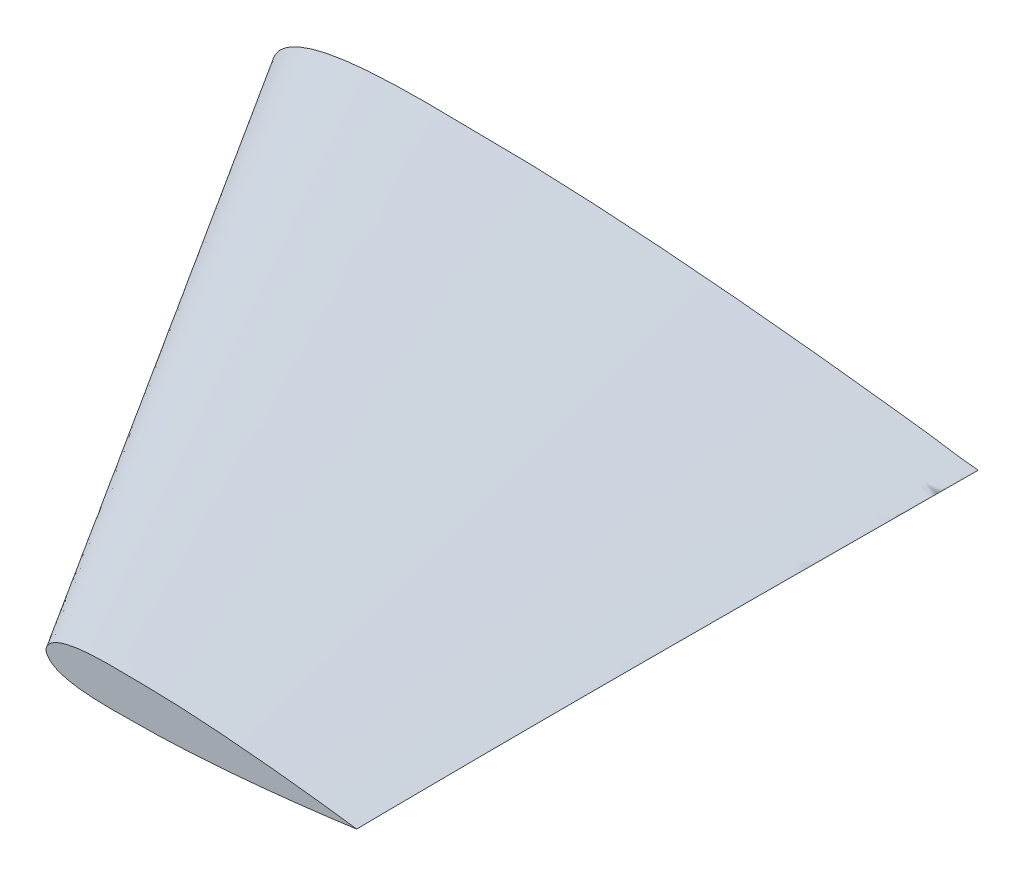
ISO-10303-21;
HEADER;
FILE_DESCRIPTION(('STEP AP214'),'2;1');
FILE_NAME('part.step','',(''),(''),'','','');
FILE_SCHEMA(('AUTOMOTIVE_DESIGN { 1 0 10303 214 1 1 1 1 }'));
ENDSEC;
DATA;
#1=APPLICATION_CONTEXT('core data for automotive mechanical design processes');
#2=APPLICATION_PROTOCOL_DEFINITION('international standard','automotive_design',2000,#1);
#3=PRODUCT_CONTEXT('',#1,'mechanical');
#4=PRODUCT('Part','Part','',(#3));
#5=PRODUCT_RELATED_PRODUCT_CATEGORY('part','',(#4));
#6=PRODUCT_DEFINITION_FORMATION('','',#4);
#7=PRODUCT_DEFINITION_CONTEXT('part definition',#1,'design');
#8=PRODUCT_DEFINITION('design','',#6,#7);
#9=PRODUCT_DEFINITION_SHAPE('','',#8);
#10=(LENGTH_UNIT() NAMED_UNIT(*) SI_UNIT(.MILLI.,.METRE.));
#11=(NAMED_UNIT(*) PLANE_ANGLE_UNIT() SI_UNIT($,.RADIAN.));
#12=(NAMED_UNIT(*) SI_UNIT($,.STERADIAN.) SOLID_ANGLE_UNIT());
#13=UNCERTAINTY_MEASURE_WITH_UNIT(LENGTH_MEASURE(1.E-05),#10,'distance_accuracy_value','');
#14=(GEOMETRIC_REPRESENTATION_CONTEXT(3) GLOBAL_UNCERTAINTY_ASSIGNED_CONTEXT((#13)) GLOBAL_UNIT_ASSIGNED_CONTEXT((#10,
#11,#12)) REPRESENTATION_CONTEXT('',''));
#15=CARTESIAN_POINT('',(0.,0.,0.));
#16=DIRECTION('',(0.,0.,1.));
#17=DIRECTION('',(1.,0.,0.));
#18=AXIS2_PLACEMENT_3D('',#15,#16,#17);
#19=CARTESIAN_POINT('',(0.,0.,0.));
#20=DIRECTION('',(0.,0.,-1.));
#21=DIRECTION('',(-1.,0.,0.));
#22=AXIS2_PLACEMENT_3D('',#19,#20,#21);
#23=PLANE('',#22);
#24=CARTESIAN_POINT('',(115.344087,0.,0.));
#25=CARTESIAN_POINT('',(115.344087,0.048005976659478,0.));
#26=CARTESIAN_POINT('',(111.811316006826,0.358720000098903,0.));
#27=CARTESIAN_POINT('',(108.969442543116,0.931874559610468,0.));
#28=CARTESIAN_POINT('',(102.77042827009,1.6608376981476,0.));
#29=CARTESIAN_POINT('',(97.1846479308605,2.35325396350409,0.));
#30=CARTESIAN_POINT('',(91.4347374133803,3.00398873091647,0.));
#31=CARTESIAN_POINT('',(85.7288964391152,3.61794510980395,0.));
#32=CARTESIAN_POINT('',(80.0113937897885,4.19428964194873,0.));
#33=CARTESIAN_POINT('',(74.2971472588871,4.73147667999269,0.));
#34=CARTESIAN_POINT('',(68.5818484866288,5.22285287566755,0.));
#35=CARTESIAN_POINT('',(62.8669817668021,5.66922038231213,0.));
#36=CARTESIAN_POINT('',(57.1138204248836,6.06283161333765,0.));
#37=CARTESIAN_POINT('',(51.3608475925614,6.39966678453262,0.));
#38=CARTESIAN_POINT('',(45.6072594909006,6.64906191128413,0.));
#39=CARTESIAN_POINT('',(39.891884492335,6.83333649174865,0.));
#40=CARTESIAN_POINT('',(35.1658740495928,6.83011586120219,0.));
#41=CARTESIAN_POINT('',(31.3945509652991,6.91794167318717,0.));
#42=CARTESIAN_POINT('',(28.5751145272068,6.95720205423096,0.));
#43=CARTESIAN_POINT('',(25.7175247887207,6.97784572512761,0.));
#44=CARTESIAN_POINT('',(22.8597026645425,6.96521348259256,0.));
#45=CARTESIAN_POINT('',(20.0015235953031,6.90591377805216,0.));
#46=CARTESIAN_POINT('',(17.1425466935499,6.78522019846571,0.));
#47=CARTESIAN_POINT('',(14.2822986262853,6.5790397616386,0.));
#48=CARTESIAN_POINT('',(11.6113978551631,6.28170913682744,0.));
#49=CARTESIAN_POINT('',(9.12996958465454,5.87483086911423,0.));
#50=CARTESIAN_POINT('',(7.22342190656808,5.4409489839296,0.));
#51=CARTESIAN_POINT('',(5.70393180130046,4.98154745689468,0.));
#52=CARTESIAN_POINT('',(4.55386270391983,4.56121122177172,0.));
#53=CARTESIAN_POINT('',(3.39703508319072,4.03413057917042,0.));
#54=CARTESIAN_POINT('',(2.21972052248671,3.34350185465448,0.));
#55=CARTESIAN_POINT('',(1.24310767880975,2.5358124801693,0.));
#56=CARTESIAN_POINT('',(0.382991984966244,1.45468452865249,0.));
#57=CARTESIAN_POINT('',(-0.250094744645004,0.,0.));
#58=CARTESIAN_POINT('',(0.382991984966248,-1.4546845286525,0.));
#59=CARTESIAN_POINT('',(1.24310767880976,-2.53581248016931,0.));
#60=CARTESIAN_POINT('',(2.21972052248669,-3.34350185465446,0.));
#61=CARTESIAN_POINT('',(3.39703508319072,-4.03413057917043,0.));
#62=CARTESIAN_POINT('',(4.55386270391984,-4.56121122177172,0.));
#63=CARTESIAN_POINT('',(5.70393180130046,-4.98154745689468,0.));
#64=CARTESIAN_POINT('',(7.22342190656807,-5.4409489839296,0.));
#65=CARTESIAN_POINT('',(9.12996958465454,-5.87483086911423,0.));
#66=CARTESIAN_POINT('',(11.6113978551631,-6.28170913682745,0.));
#67=CARTESIAN_POINT('',(14.2822986262853,-6.5790397616386,0.));
#68=CARTESIAN_POINT('',(17.1425466935499,-6.78522019846571,0.));
#69=CARTESIAN_POINT('',(20.0015235953031,-6.90591377805216,0.));
#70=CARTESIAN_POINT('',(22.8597026645426,-6.96521348259257,0.));
#71=CARTESIAN_POINT('',(25.7175247887207,-6.97784572512761,0.));
#72=CARTESIAN_POINT('',(28.5751145272068,-6.95720205423096,0.));
#73=CARTESIAN_POINT('',(31.3945509652991,-6.91794167318717,0.));
#74=CARTESIAN_POINT('',(35.1658740495928,-6.83011586120218,0.));
#75=CARTESIAN_POINT('',(39.8918844923351,-6.83333649174865,0.));
#76=CARTESIAN_POINT('',(45.6072594909006,-6.64906191128413,0.));
#77=CARTESIAN_POINT('',(51.3608475925614,-6.39966678453262,0.));
#78=CARTESIAN_POINT('',(57.1138204248836,-6.06283161333765,0.));
#79=CARTESIAN_POINT('',(62.8669817668021,-5.66922038231213,0.));
#80=CARTESIAN_POINT('',(68.5818484866288,-5.22285287566755,0.));
#81=CARTESIAN_POINT('',(74.2971472588871,-4.73147667999269,0.));
#82=CARTESIAN_POINT('',(80.0113937897886,-4.19428964194872,0.));
#83=CARTESIAN_POINT('',(85.7288964391152,-3.61794510980396,0.));
#84=CARTESIAN_POINT('',(91.4347374133803,-3.00398873091647,0.));
#85=CARTESIAN_POINT('',(97.1846479308605,-2.35325396350409,0.));
#86=CARTESIAN_POINT('',(102.77042827009,-1.6608376981476,0.));
#87=CARTESIAN_POINT('',(108.969442543116,-0.931874559610468,0.));
#88=CARTESIAN_POINT('',(111.811316006826,-0.358720000098902,0.));
#89=CARTESIAN_POINT('',(115.344087,-0.0480059766594781,0.));
#90=CARTESIAN_POINT('',(115.344087,0.,0.));
#91=B_SPLINE_CURVE_WITH_KNOTS('',3,(#24,#25,#26,#27,#28,#29,#30,#31,#32,#33,#34,#35,#36,#37,#38,
#39,#40,#41,#42,#43,#44,#45,#46,#47,#48,#49,#50,#51,#52,#53,#54,#55,#56,#57,#58,#59,#60,#61,#62,
#63,#64,#65,#66,#67,#68,#69,#70,#71,#72,#73,#74,#75,#76,#77,#78,#79,#80,#81,#82,#83,#84,#85,#86,
#87,#88,#89,#90),.UNSPECIFIED.,.T.,.F.,(4,1,1,1,1,1,1,1,1,1,1,1,1,1,1,1,1,1,1,1,1,1,1,1,1,1,1,1,
1,1,1,1,1,1,1,1,1,1,1,1,1,1,1,1,1,1,1,1,1,1,1,1,1,1,1,1,1,1,1,1,1,1,1,1,4),(0.,
0.00446137220586428,0.028875798486046,0.053264861155878,0.0776323881888755,0.101980154123087,
0.126310352974612,0.150624020523395,0.174921289070994,0.199201662612025,0.223465844256172,
0.247713447658258,0.272429314586425,0.29664379995705,0.32084477133081,0.345037109446349,
0.356650960366951,0.368747754231671,0.380843541809942,0.392939245204686,0.405037606387336,
0.417144637361775,0.429272893507878,0.441447325431185,0.451256966650156,0.461192589138198,
0.466249429860327,0.471406525519664,0.476732080599958,0.482366907508069,0.488719912473639,
0.492634074027092,0.5,0.507365925972909,0.511280087526361,0.517633092491931,0.523267919400043,
0.528593474480336,0.533750570139673,0.538807410861802,0.548743033349844,0.558552674568815,
0.570727106492122,0.582855362638225,0.594962393612664,0.607060754795314,0.619156458190058,
0.631252245768329,0.643349039633049,0.654962890553651,0.67915522866919,0.70335620004295,
0.727570685413575,0.752286552341742,0.776534155743828,0.800798337387975,0.825078710929006,
0.849375979476605,0.873689647025388,0.898019845876913,0.922367611811124,0.946735138844122,
0.971124201513954,0.995538627794136,1.),.UNSPECIFIED.);
#92=CARTESIAN_POINT('',(115.344087,0.,0.));
#93=VERTEX_POINT('',#92);
#94=EDGE_CURVE('E11',#93,#93,#91,.T.);
#95=ORIENTED_EDGE('',*,*,#94,.F.);
#96=EDGE_LOOP('',(#95));
#97=FACE_BOUND('',#96,.T.);
#98=ADVANCED_FACE('F55',(#97),#23,.T.);
#99=CARTESIAN_POINT('',(64.544087,0.,101.6));
#100=DIRECTION('',(0.,0.,-1.));
#101=DIRECTION('',(-1.,0.,0.));
#102=AXIS2_PLACEMENT_3D('',#99,#100,#101);
#103=PLANE('',#102);
#104=CARTESIAN_POINT('',(115.344087,0.,101.6));
#105=CARTESIAN_POINT('',(115.344087,0.0211428576681305,101.6));
#106=CARTESIAN_POINT('',(113.788179184342,0.157987951346166,101.6));
#107=CARTESIAN_POINT('',(112.536557400241,0.410417463603584,101.6));
#108=CARTESIAN_POINT('',(109.806379085424,0.731468402588309,101.6));
#109=CARTESIAN_POINT('',(107.346282095512,1.03642331787676,101.6));
#110=CARTESIAN_POINT('',(104.8138986688,1.32302081103259,101.6));
#111=CARTESIAN_POINT('',(102.300924410374,1.59342031618871,101.6));
#112=CARTESIAN_POINT('',(99.7828141011236,1.84725476054088,101.6));
#113=CARTESIAN_POINT('',(97.2661378559877,2.08384340797309,101.6));
#114=CARTESIAN_POINT('',(94.7489981812792,2.3002559817731,101.6));
#115=CARTESIAN_POINT('',(92.2320487916916,2.49684576740766,101.6));
#116=CARTESIAN_POINT('',(89.6982336324502,2.67020056223208,101.6));
#117=CARTESIAN_POINT('',(87.1645014968621,2.81854996740535,101.6));
#118=CARTESIAN_POINT('',(84.6304983835134,2.92838890903204,101.6));
#119=CARTESIAN_POINT('',(82.1133251371107,3.00954737090964,101.6));
#120=CARTESIAN_POINT('',(80.0318891767975,3.00812893641494,101.6));
#121=CARTESIAN_POINT('',(78.3709179240438,3.04680930022793,101.6));
#122=CARTESIAN_POINT('',(77.1291778853447,3.06410041075555,101.6));
#123=CARTESIAN_POINT('',(75.8706343180868,3.07319232442729,101.6));
#124=CARTESIAN_POINT('',(74.6119884032056,3.0676288149534,101.6));
#125=CARTESIAN_POINT('',(73.353185282094,3.04151195825963,101.6));
#126=CARTESIAN_POINT('',(72.0940307784994,2.98835592744384,101.6));
#127=CARTESIAN_POINT('',(70.8343164264577,2.89754965845133,101.6));
#128=CARTESIAN_POINT('',(69.6579946686461,2.7665988994375,101.6));
#129=CARTESIAN_POINT('',(68.5651206477886,2.58740101823331,101.6));
#130=CARTESIAN_POINT('',(67.7254363209553,2.3963101670189,101.6));
#131=CARTESIAN_POINT('',(67.0562204178671,2.19397992035984,101.6));
#132=CARTESIAN_POINT('',(66.5497054185595,2.00885486280707,101.6));
#133=CARTESIAN_POINT('',(66.0402138211876,1.77671728782981,101.6));
#134=CARTESIAN_POINT('',(65.52169933779,1.47254964371459,101.6));
#135=CARTESIAN_POINT('',(65.0915781781437,1.11682598859696,101.6));
#136=CARTESIAN_POINT('',(64.712764852002,0.640674142711225,101.6));
#137=CARTESIAN_POINT('',(64.4339399317071,-1.01460631852582E-13,101.6));
#138=CARTESIAN_POINT('',(64.712764852002,-0.640674142711446,101.6));
#139=CARTESIAN_POINT('',(65.0915781781437,-1.11682598859717,101.6));
#140=CARTESIAN_POINT('',(65.52169933779,-1.4725496437148,101.6));
#141=CARTESIAN_POINT('',(66.0402138211876,-1.77671728783002,101.6));
#142=CARTESIAN_POINT('',(66.5497054185595,-2.00885486280728,101.6));
#143=CARTESIAN_POINT('',(67.0562204178671,-2.19397992036004,101.6));
#144=CARTESIAN_POINT('',(67.7254363209553,-2.3963101670191,101.6));
#145=CARTESIAN_POINT('',(68.5651206477886,-2.58740101823351,101.6));
#146=CARTESIAN_POINT('',(69.6579946686461,-2.76659889943769,101.6));
#147=CARTESIAN_POINT('',(70.8343164264577,-2.89754965845152,101.6));
#148=CARTESIAN_POINT('',(72.0940307784993,-2.98835592744402,101.6));
#149=CARTESIAN_POINT('',(73.353185282094,-3.04151195825981,101.6));
#150=CARTESIAN_POINT('',(74.6119884032056,-3.06762881495358,101.6));
#151=CARTESIAN_POINT('',(75.8706343180868,-3.07319232442745,101.6));
#152=CARTESIAN_POINT('',(77.1291778853447,-3.0641004107557,101.6));
#153=CARTESIAN_POINT('',(78.3709179240438,-3.04680930022809,101.6));
#154=CARTESIAN_POINT('',(80.0318891767975,-3.00812893641509,101.6));
#155=CARTESIAN_POINT('',(82.1133251371108,-3.00954737090979,101.6));
#156=CARTESIAN_POINT('',(84.6304983835134,-2.92838890903217,101.6));
#157=CARTESIAN_POINT('',(87.1645014968621,-2.81854996740547,101.6));
#158=CARTESIAN_POINT('',(89.6982336324502,-2.67020056223219,101.6));
#159=CARTESIAN_POINT('',(92.2320487916916,-2.49684576740776,101.6));
#160=CARTESIAN_POINT('',(94.7489981812793,-2.30025598177319,101.6));
#161=CARTESIAN_POINT('',(97.2661378559877,-2.08384340797316,101.6));
#162=CARTESIAN_POINT('',(99.7828141011236,-1.84725476054095,101.6));
#163=CARTESIAN_POINT('',(102.300924410374,-1.59342031618876,101.6));
#164=CARTESIAN_POINT('',(104.8138986688,-1.32302081103264,101.6));
#165=CARTESIAN_POINT('',(107.346282095512,-1.03642331787679,101.6));
#166=CARTESIAN_POINT('',(109.806379085424,-0.73146840258833,101.6));
#167=CARTESIAN_POINT('',(112.536557400241,-0.410417463603595,101.6));
#168=CARTESIAN_POINT('',(113.788179184342,-0.157987951346171,101.6));
#169=CARTESIAN_POINT('',(115.344087,-0.0211428576681308,101.6));
#170=CARTESIAN_POINT('',(115.344087,0.,101.6));
#171=B_SPLINE_CURVE_WITH_KNOTS('',3,(#104,#105,#106,#107,#108,#109,#110,#111,#112,#113,#114,
#115,#116,#117,#118,#119,#120,#121,#122,#123,#124,#125,#126,#127,#128,#129,#130,#131,#132,#133,
#134,#135,#136,#137,#138,#139,#140,#141,#142,#143,#144,#145,#146,#147,#148,#149,#150,#151,#152,
#153,#154,#155,#156,#157,#158,#159,#160,#161,#162,#163,#164,#165,#166,#167,#168,#169,#170),
.UNSPECIFIED.,.T.,.F.,(4,1,1,1,1,1,1,1,1,1,1,1,1,1,1,1,1,1,1,1,1,1,1,1,1,1,1,1,1,1,1,1,1,1,1,1,
1,1,1,1,1,1,1,1,1,1,1,1,1,1,1,1,1,1,1,1,1,1,1,1,1,1,1,1,4),(0.,0.00446137220586428,
0.028875798486046,0.053264861155878,0.0776323881888755,0.101980154123087,0.126310352974612,
0.150624020523395,0.174921289070994,0.199201662612025,0.223465844256172,0.247713447658258,
0.272429314586425,0.29664379995705,0.32084477133081,0.345037109446349,0.356650960366951,
0.368747754231671,0.380843541809942,0.392939245204686,0.405037606387336,0.417144637361775,
0.429272893507878,0.441447325431185,0.451256966650156,0.461192589138198,0.466249429860327,
0.471406525519664,0.476732080599958,0.482366907508069,0.488719912473639,0.492634074027092,0.5,
0.507365925972909,0.511280087526361,0.517633092491931,0.523267919400043,0.528593474480336,
0.533750570139673,0.538807410861802,0.548743033349844,0.558552674568815,0.570727106492122,
0.582855362638225,0.594962393612664,0.607060754795314,0.619156458190058,0.631252245768329,
0.643349039633049,0.654962890553651,0.67915522866919,0.70335620004295,0.727570685413575,
0.752286552341742,0.776534155743828,0.800798337387975,0.825078710929006,0.849375979476605,
0.873689647025388,0.898019845876913,0.922367611811124,0.946735138844122,0.971124201513954,
0.995538627794136,1.),.UNSPECIFIED.);
#172=CARTESIAN_POINT('',(115.344087,0.,101.6));
#173=VERTEX_POINT('',#172);
#174=EDGE_CURVE('E66',#173,#173,#171,.T.);
#175=ORIENTED_EDGE('',*,*,#174,.T.);
#176=EDGE_LOOP('',(#175));
#177=FACE_BOUND('',#176,.T.);
#178=ADVANCED_FACE('F96',(#177),#103,.F.);
#179=CARTESIAN_POINT('',(114.893316366915,0.0625560568440305,101.6));
#180=CARTESIAN_POINT('',(115.344087,0.,0.));
#181=CARTESIAN_POINT('',(115.108516872055,0.0417038459946317,101.6));
#182=CARTESIAN_POINT('',(115.344087,-0.0473455895714366,0.));
#183=CARTESIAN_POINT('',(115.346873242033,0.0205611136842713,101.6));
#184=CARTESIAN_POINT('',(114.805774877357,-0.0953515662309148,0.));
#185=CARTESIAN_POINT('',(115.341275734481,-0.0214336574115908,101.6));
#186=CARTESIAN_POINT('',(113.814797103914,-0.190703269628489,0.));
#187=CARTESIAN_POINT('',(114.022480330482,-0.137426897293959,101.6));
#188=CARTESIAN_POINT('',(111.338529671101,-0.454072466510907,0.));
#189=CARTESIAN_POINT('',(113.212573238504,-0.273982177472963,101.6));
#190=CARTESIAN_POINT('',(109.719692065332,-0.76205594276077,0.));
#191=CARTESIAN_POINT('',(111.918374544296,-0.478016299682489,101.6));
#192=CARTESIAN_POINT('',(106.528297816739,-1.21893705745085,0.));
#193=CARTESIAN_POINT('',(110.879887714428,-0.605245712456014,101.6));
#194=CARTESIAN_POINT('',(104.110894821846,-1.50447163818352,0.));
#195=CARTESIAN_POINT('',(109.291205500202,-0.795936985553682,101.6));
#196=CARTESIAN_POINT('',(100.570704616769,-1.93351659784437,0.));
#197=CARTESIAN_POINT('',(108.313663876189,-0.91650197795283,101.6));
#198=CARTESIAN_POINT('',(98.3666281978971,-2.20452869848878,0.));
#199=CARTESIAN_POINT('',(106.803958335921,-1.09685943996957,101.6));
#200=CARTESIAN_POINT('',(94.9201590193574,-2.60953302396166,0.));
#201=CARTESIAN_POINT('',(105.809942894033,-1.21029649596112,101.6));
#202=CARTESIAN_POINT('',(92.6586435876298,-2.86434380713636,0.));
#203=CARTESIAN_POINT('',(104.279234974144,-1.38004915786537,101.6));
#204=CARTESIAN_POINT('',(89.187491043494,-3.24579554781626,0.));
#205=CARTESIAN_POINT('',(103.28948334934,-1.48704974697243,101.6));
#206=CARTESIAN_POINT('',(86.9410617923464,-3.48612970263438,0.));
#207=CARTESIAN_POINT('',(101.764539788348,-1.6468820795278,101.6));
#208=CARTESIAN_POINT('',(83.4768751595392,-3.84495683684008,0.));
#209=CARTESIAN_POINT('',(100.773516194497,-1.74738854339879,101.6));
#210=CARTESIAN_POINT('',(81.2261265321865,-4.07045578295246,0.));
#211=CARTESIAN_POINT('',(99.2471720605546,-1.8970002197962,101.6));
#212=CARTESIAN_POINT('',(77.7604124861723,-4.40590073934238,0.));
#213=CARTESIAN_POINT('',(98.2563684129524,-1.9907534248622,101.6));
#214=CARTESIAN_POINT('',(75.5105407852809,-4.61576927153904,0.));
#215=CARTESIAN_POINT('',(96.7305331401382,-2.12917187471729,101.6));
#216=CARTESIAN_POINT('',(72.0455086356042,-4.92506264370709,0.));
#217=CARTESIAN_POINT('',(95.7395246199762,-2.21509488875959,101.6));
#218=CARTESIAN_POINT('',(69.7950718914227,-5.11693925812752,0.));
#219=CARTESIAN_POINT('',(94.2136756403273,-2.34136158490454,101.6));
#220=CARTESIAN_POINT('',(66.330170346391,-5.39872328638722,0.));
#221=CARTESIAN_POINT('',(93.2226028347834,-2.41947718374009,101.6));
#222=CARTESIAN_POINT('',(64.079617704914,-5.57252656912945,0.));
#223=CARTESIAN_POINT('',(91.6968947471969,-2.53258857610555,101.6));
#224=CARTESIAN_POINT('',(60.6149682541965,-5.823295291445,0.));
#225=CARTESIAN_POINT('',(90.7056976608273,-2.60127338784246,101.6));
#226=CARTESIAN_POINT('',(58.3641264950417,-5.97529313892105,0.));
#227=CARTESIAN_POINT('',(89.1633133701453,-2.70062674121956,101.6));
#228=CARTESIAN_POINT('',(54.8616546938961,-6.19469537346084,0.));
#229=CARTESIAN_POINT('',(88.1552567095542,-2.76054148870907,101.6));
#230=CARTESIAN_POINT('',(52.5725225868583,-6.32559173583011,0.));
#231=CARTESIAN_POINT('',(86.612949766458,-2.84110300004008,101.6));
#232=CARTESIAN_POINT('',(49.0701642420533,-6.49895878362144,0.));
#233=CARTESIAN_POINT('',(85.6215231166663,-2.88543193426926,101.6));
#234=CARTESIAN_POINT('',(46.8188203915534,-6.59427256978015,0.));
#235=CARTESIAN_POINT('',(84.0960607739657,-2.94462011084401,101.6));
#236=CARTESIAN_POINT('',(43.3548496138422,-6.7216838976338,0.));
#237=CARTESIAN_POINT('',(83.104566761996,-2.97758785213418,101.6));
#238=CARTESIAN_POINT('',(41.103395010799,-6.78753222507259,0.));
#239=CARTESIAN_POINT('',(81.5790721951566,-3.00621606386707,101.6));
#240=CARTESIAN_POINT('',(37.6393451541999,-6.83180145557228,0.));
#241=CARTESIAN_POINT('',(80.5873529738835,-3.00850746788344,101.6));
#242=CARTESIAN_POINT('',(35.3875879438284,-6.83689720682604,0.));
#243=CARTESIAN_POINT('',(79.4982058439197,-3.02219332845027,101.6));
#244=CARTESIAN_POINT('',(32.9148462795954,-6.88253734227977,0.));
#245=CARTESIAN_POINT('',(78.9429219771395,-3.03348858511057,101.6));
#246=CARTESIAN_POINT('',(31.6540643727521,-6.90970730784723,0.));
#247=CARTESIAN_POINT('',(78.2733185702431,-3.04717451706164,101.6));
#248=CARTESIAN_POINT('',(30.1336033694565,-6.93550024709938,0.));
#249=CARTESIAN_POINT('',(77.7012393434641,-3.05613451000945,101.6));
#250=CARTESIAN_POINT('',(28.8346108286718,-6.95200542598601,0.));
#251=CARTESIAN_POINT('',(77.0148313824629,-3.0642293011292,101.6));
#252=CARTESIAN_POINT('',(27.2760432406621,-6.96658674642436,0.));
#253=CARTESIAN_POINT('',(76.4427352451447,-3.06905937871492,101.6));
#254=CARTESIAN_POINT('',(25.9770421873524,-6.97321968290395,0.));
#255=CARTESIAN_POINT('',(75.7563220984255,-3.07147538150818,101.6));
#256=CARTESIAN_POINT('',(24.4184832136924,-6.97210365738308,0.));
#257=CARTESIAN_POINT('',(75.184203324828,-3.0701581388086,101.6));
#258=CARTESIAN_POINT('',(23.1194919414371,-6.96250530211629,0.));
#259=CARTESIAN_POINT('',(74.4977234395677,-3.06355904014819,101.6));
#260=CARTESIAN_POINT('',(21.5609078633543,-6.93826690363327,0.));
#261=CARTESIAN_POINT('',(73.9255950619422,-3.05338795692845,101.6));
#262=CARTESIAN_POINT('',(20.26204950419,-6.90625282983118,0.));
#263=CARTESIAN_POINT('',(73.2389436979961,-3.03445537198114,101.6));
#264=CARTESIAN_POINT('',(18.7033210820489,-6.85110930997245,0.));
#265=CARTESIAN_POINT('',(72.6668229184857,-3.01253672222118,101.6));
#266=CARTESIAN_POINT('',(17.4048244324285,-6.78926036113455,0.));
#267=CARTESIAN_POINT('',(71.9797842619133,-2.97701432422205,101.6));
#268=CARTESIAN_POINT('',(15.8457994324965,-6.69174441928477,0.));
#269=CARTESIAN_POINT('',(71.407763580712,-2.93888648727927,101.6));
#270=CARTESIAN_POINT('',(14.5481629394373,-6.5890112236249,0.));
#271=CARTESIAN_POINT('',(70.7198892787197,-2.88073764385457,101.6));
#272=CARTESIAN_POINT('',(12.9881820118106,-6.43497581672514,0.));
#273=CARTESIAN_POINT('',(70.1479966851396,-2.82114701567546,101.6));
#274=CARTESIAN_POINT('',(11.6922993642324,-6.27713835876196,0.));
#275=CARTESIAN_POINT('',(69.543158381092,-2.74260608348035,101.6));
#276=CARTESIAN_POINT('',(10.3229061219489,-6.07043593961125,0.));
#277=CARTESIAN_POINT('',(69.0559470508136,-2.66788152173393,101.6));
#278=CARTESIAN_POINT('',(9.22100522902006,-5.87427600384056,0.));
#279=CARTESIAN_POINT('',(68.5321619569345,-2.57294363907453,101.6));
#280=CARTESIAN_POINT('',(8.03766878602079,-5.62625091743132,0.));
#281=CARTESIAN_POINT('',(68.0456011263193,-2.46917155460345,101.6));
#282=CARTESIAN_POINT('',(6.94182551500587,-5.35314423619453,0.));
#283=CARTESIAN_POINT('',(67.689503927009,-2.3784213419454,101.6));
#284=CARTESIAN_POINT('',(6.14236416892157,-5.11410277824124,0.));
#285=CARTESIAN_POINT('',(67.373634831013,-2.28994676186604,101.6));
#286=CARTESIAN_POINT('',(5.43492630788226,-4.88117701016983,0.));
#287=CARTESIAN_POINT('',(67.1807705722297,-2.23086673894184,101.6));
#288=CARTESIAN_POINT('',(5.00403629300061,-4.72574418071912,0.));
#289=CARTESIAN_POINT('',(66.8667131879421,-2.12471733801896,101.6));
#290=CARTESIAN_POINT('',(4.30568553210195,-4.44455249547297,0.));
#291=CARTESIAN_POINT('',(66.6688794990621,-2.05115977694476,101.6));
#292=CARTESIAN_POINT('',(3.86790473479492,-4.24867099478789,0.));
#293=CARTESIAN_POINT('',(66.3574259869732,-1.92124737095324,101.6));
#294=CARTESIAN_POINT('',(3.18459229898422,-3.9025599265916,0.));
#295=CARTESIAN_POINT('',(66.1509658743446,-1.82500551671765,101.6));
#296=CARTESIAN_POINT('',(2.7356949514521,-3.6461794683129,0.));
#297=CARTESIAN_POINT('',(65.8437385107379,-1.66146220003637,101.6));
#298=CARTESIAN_POINT('',(2.07758071835909,-3.20573820907188,0.));
#299=CARTESIAN_POINT('',(65.6187593780928,-1.52440374911597,101.6));
#300=CARTESIAN_POINT('',(1.60343672831195,-2.83381587679219,0.));
#301=CARTESIAN_POINT('',(65.3301200376527,-1.31282361585721,101.6));
#302=CARTESIAN_POINT('',(1.0284823057436,-2.26603773755339,0.));
#303=CARTESIAN_POINT('',(65.1639760867353,-1.16639341043867,101.6));
#304=CARTESIAN_POINT('',(0.718592292040511,-1.87651949238195,0.));
#305=CARTESIAN_POINT('',(64.9655333074289,-0.958393077942895,101.6));
#306=CARTESIAN_POINT('',(0.361120625207274,-1.31258734425891,0.));
#307=CARTESIAN_POINT('',(64.8072904513226,-0.759488702532692,101.6));
#308=CARTESIAN_POINT('',(0.0940598184259018,-0.768145078402327,0.));
#309=CARTESIAN_POINT('',(64.6098828147368,-0.404275398454328,101.6));
#310=CARTESIAN_POINT('',(-0.0601537698108428,0.111880499562982,0.));
#311=CARTESIAN_POINT('',(64.5175939947158,-0.0492745621005383,101.6));
#312=CARTESIAN_POINT('',(0.149392877543898,0.917928675812264,0.));
#313=CARTESIAN_POINT('',(64.5855129534261,0.338307502341462,101.6));
#314=CARTESIAN_POINT('',(0.597617358032397,1.7244592712684,0.));
#315=CARTESIAN_POINT('',(64.7031322379282,0.578091507095118,101.6));
#316=CARTESIAN_POINT('',(0.956916132872215,2.1760821764258,0.));
#317=CARTESIAN_POINT('',(64.8605703966362,0.826459272359498,101.6));
#318=CARTESIAN_POINT('',(1.40749095966025,2.64835793326481,0.));
#319=CARTESIAN_POINT('',(64.9970525788231,0.998011428775709,101.6));
#320=CARTESIAN_POINT('',(1.7847295881867,2.98083545990308,0.));
#321=CARTESIAN_POINT('',(65.2502747892211,1.24807305068903,101.6));
#322=CARTESIAN_POINT('',(2.44010047785895,3.46123934372337,0.));
#323=CARTESIAN_POINT('',(65.4590979315326,1.41187559116784,101.6));
#324=CARTESIAN_POINT('',(2.95092749850862,3.77243780606682,0.));
#325=CARTESIAN_POINT('',(65.748945499021,1.60585533084399,101.6));
#326=CARTESIAN_POINT('',(3.64850347796974,4.14377155700291,0.));
#327=CARTESIAN_POINT('',(65.9466494806272,1.71877076170226,101.6));
#328=CARTESIAN_POINT('',(4.11728208413228,4.36229377763267,0.));
#329=CARTESIAN_POINT('',(66.2475948748994,1.87120547007505,101.6));
#330=CARTESIAN_POINT('',(4.82445375725914,4.65726676698435,0.));
#331=CARTESIAN_POINT('',(66.4404028903046,1.95747586757538,101.6));
#332=CARTESIAN_POINT('',(5.27364561201702,4.82428310013495,0.));
#333=CARTESIAN_POINT('',(66.747971484208,2.08131869283008,101.6));
#334=CARTESIAN_POINT('',(5.98672951469937,5.06530092956499,0.));
#335=CARTESIAN_POINT('',(66.9377446518259,2.14977463141752,101.6));
#336=CARTESIAN_POINT('',(6.42463801557136,5.19944524657545,0.));
#337=CARTESIAN_POINT('',(67.249315398758,2.25236011564809,101.6));
#338=CARTESIAN_POINT('',(7.14183550551561,5.4003314603936,0.));
#339=CARTESIAN_POINT('',(67.6014152543933,2.35763908035156,101.6));
#340=CARTESIAN_POINT('',(7.9503730318485,5.60638461834831,0.));
#341=CARTESIAN_POINT('',(68.084048041348,2.47792109712135,101.6));
#342=CARTESIAN_POINT('',(9.05513513376314,5.84200462502947,0.));
#343=CARTESIAN_POINT('',(68.6052146903533,2.58715664371325,101.6));
#344=CARTESIAN_POINT('',(10.2444168943477,6.05756610922361,0.));
#345=CARTESIAN_POINT('',(69.0905153834073,2.67354966997346,101.6));
#346=CARTESIAN_POINT('',(11.350655990155,6.22723217912746,0.));
#347=CARTESIAN_POINT('',(69.6936254215318,2.76458583113234,101.6));
#348=CARTESIAN_POINT('',(12.7239733516315,6.40556351999703,0.));
#349=CARTESIAN_POINT('',(70.2643598233479,2.83410081948654,101.6));
#350=CARTESIAN_POINT('',(14.0224857348709,6.54086719324656,0.));
#351=CARTESIAN_POINT('',(70.9514087496049,2.90194130332953,101.6));
#352=CARTESIAN_POINT('',(15.5843407217619,6.67289721794986,0.));
#353=CARTESIAN_POINT('',(71.5229155824381,2.94718719737801,101.6));
#354=CARTESIAN_POINT('',(16.8831439347204,6.75946848845086,0.));
#355=CARTESIAN_POINT('',(72.2095434977169,2.99013530139282,101.6));
#356=CARTESIAN_POINT('',(18.443101544485,6.84012397201898,0.));
#357=CARTESIAN_POINT('',(72.7814291618751,3.01737489973448,101.6));
#358=CARTESIAN_POINT('',(19.7421320359486,6.88989142565747,0.));
#359=CARTESIAN_POINT('',(73.467926457959,3.04166128390625,101.6));
#360=CARTESIAN_POINT('',(21.3012102773201,6.93287886119484,0.));
#361=CARTESIAN_POINT('',(74.0399714267276,3.05576096592242,101.6));
#362=CARTESIAN_POINT('',(22.6002580207061,6.95597284363148,0.));
#363=CARTESIAN_POINT('',(74.7264051506046,3.06643607441704,101.6));
#364=CARTESIAN_POINT('',(24.158946910651,6.9709564461907,0.));
#365=CARTESIAN_POINT('',(75.2985086571373,3.07066339512532,101.6));
#366=CARTESIAN_POINT('',(25.4579728475835,6.97394731541394,0.));
#367=CARTESIAN_POINT('',(75.9849313244905,3.07115491660627,101.6));
#368=CARTESIAN_POINT('',(27.0165102041413,6.96846165328051,0.));
#369=CARTESIAN_POINT('',(76.5570391388108,3.06823362968184,101.6));
#370=CARTESIAN_POINT('',(28.3154847442043,6.95749470664147,0.));
#371=CARTESIAN_POINT('',(77.243465600106,3.06181170466138,101.6));
#372=CARTESIAN_POINT('',(29.8740103263131,6.93911505524062,0.));
#373=CARTESIAN_POINT('',(77.8155696653201,3.05454247128108,101.6));
#374=CARTESIAN_POINT('',(31.172946470102,6.91877091732543,0.));
#375=CARTESIAN_POINT('',(78.4852131726461,3.04318270982223,101.6));
#376=CARTESIAN_POINT('',(32.6933164232685,6.88769628493092,0.));
#377=CARTESIAN_POINT('',(79.0404884584117,3.03121647655683,101.6));
#378=CARTESIAN_POINT('',(33.9541178138125,6.86204980723579,0.));
#379=CARTESIAN_POINT('',(80.1295367122662,3.01111558589696,101.6));
#380=CARTESIAN_POINT('',(36.4270839813816,6.83097533692299,0.));
#381=CARTESIAN_POINT('',(81.1212586915049,3.0088713081847,101.6));
#382=CARTESIAN_POINT('',(38.6788349289271,6.825772582903,0.));
#383=CARTESIAN_POINT('',(82.6469002509593,2.98937419335316,101.6));
#384=CARTESIAN_POINT('',(42.142551032218,6.7607707139114,0.));
#385=CARTESIAN_POINT('',(83.6384889567936,2.96037318323741,101.6));
#386=CARTESIAN_POINT('',(44.3937906303632,6.6859157135262,0.));
#387=CARTESIAN_POINT('',(85.1640956861176,2.90425851257394,101.6));
#388=CARTESIAN_POINT('',(47.8574335659483,6.55152582793164,0.));
#389=CARTESIAN_POINT('',(86.1556356092808,2.86228028496955,101.6));
#390=CARTESIAN_POINT('',(50.1085202138572,6.45087463804296,0.));
#391=CARTESIAN_POINT('',(87.6981490512293,2.78592573349846,101.6));
#392=CARTESIAN_POINT('',(53.6104097097498,6.26795546536913,0.));
#393=CARTESIAN_POINT('',(88.7063317485214,2.72827617918546,101.6));
#394=CARTESIAN_POINT('',(55.8992556800791,6.13191586208121,0.));
#395=CARTESIAN_POINT('',(90.2488951286312,2.63164674802186,101.6));
#396=CARTESIAN_POINT('',(59.401320782208,5.90632881807317,0.));
#397=CARTESIAN_POINT('',(91.240213870253,2.56470364887198,101.6));
#398=CARTESIAN_POINT('',(61.6518861856065,5.75037632003156,0.));
#399=CARTESIAN_POINT('',(92.7661195909965,2.45425974642354,101.6));
#400=CARTESIAN_POINT('',(65.1160871439828,5.49355092078119,0.));
#401=CARTESIAN_POINT('',(93.7573112533272,2.37771306777997,101.6));
#402=CARTESIAN_POINT('',(67.3663704053063,5.31618532179854,0.));
#403=CARTESIAN_POINT('',(95.2833275869184,2.25360936197569,101.6));
#404=CARTESIAN_POINT('',(70.8308910527431,5.02949010950521,0.));
#405=CARTESIAN_POINT('',(96.2744672551905,2.16910280186847,101.6));
#406=CARTESIAN_POINT('',(73.0810281856865,4.8343973613488,0.));
#407=CARTESIAN_POINT('',(97.8005426598552,2.03288339348007,101.6));
#408=CARTESIAN_POINT('',(76.545518509683,4.52011094942668,0.));
#409=CARTESIAN_POINT('',(98.7914370217031,1.94045280877437,101.6));
#410=CARTESIAN_POINT('',(78.7951910854416,4.30723933832242,0.));
#411=CARTESIAN_POINT('',(100.317806955372,1.79271568344997,101.6));
#412=CARTESIAN_POINT('',(82.2608338221701,3.96753811377875,0.));
#413=CARTESIAN_POINT('',(101.30907426962,1.69340112923763,101.6));
#414=CARTESIAN_POINT('',(84.51100349231,3.73933287158003,0.));
#415=CARTESIAN_POINT('',(102.834793146757,1.53536599542502,101.6));
#416=CARTESIAN_POINT('',(87.9734772984694,3.37642510552329,0.));
#417=CARTESIAN_POINT('',(103.824207669792,1.42951770325831,101.6));
#418=CARTESIAN_POINT('',(90.2207675110154,3.13347460762883,0.));
#419=CARTESIAN_POINT('',(105.352913574062,1.26151820145466,101.6));
#420=CARTESIAN_POINT('',(93.6962879682798,2.7480422131646,0.));
#421=CARTESIAN_POINT('',(106.348787238675,1.14929407465452,101.6));
#422=CARTESIAN_POINT('',(95.9532272016361,2.49047737993335,0.));
#423=CARTESIAN_POINT('',(107.86692447332,0.970921541154582,101.6));
#424=CARTESIAN_POINT('',(99.3812161703642,2.08096621056185,0.));
#425=CARTESIAN_POINT('',(108.838192515209,0.851562076194911,101.6));
#426=CARTESIAN_POINT('',(101.600871107738,1.80721700883263,0.));
#427=CARTESIAN_POINT('',(110.396475995623,0.66260142242686,101.6));
#428=CARTESIAN_POINT('',(105.207599714167,1.37424243206508,0.));
#429=CARTESIAN_POINT('',(111.45911265946,0.536845692284041,101.6));
#430=CARTESIAN_POINT('',(107.565183880457,1.08536135571922,0.));
#431=CARTESIAN_POINT('',(112.868005848554,0.335625817678833,101.6));
#432=CARTESIAN_POINT('',(110.505443416411,0.622090920336993,0.));
#433=CARTESIAN_POINT('',(113.59013372322,0.199695161342799,101.6));
#434=CARTESIAN_POINT('',(112.349628129469,0.311374410527466,0.));
#435=CARTESIAN_POINT('',(114.675114196019,0.0836991190890222,101.6));
#436=CARTESIAN_POINT('',(115.344087,0.0480059766594782,0.));
#437=CARTESIAN_POINT('',(114.893316366915,0.0625560568440305,101.6));
#438=CARTESIAN_POINT('',(115.344087,0.,0.));
#439=B_SPLINE_SURFACE_WITH_KNOTS('',3,1,((#179,#180),(#181,#182),(#183,#184),(#185,#186),(#187,
#188),(#189,#190),(#191,#192),(#193,#194),(#195,#196),(#197,#198),(#199,#200),(#201,#202),(#203,
#204),(#205,#206),(#207,#208),(#209,#210),(#211,#212),(#213,#214),(#215,#216),(#217,#218),(#219,
#220),(#221,#222),(#223,#224),(#225,#226),(#227,#228),(#229,#230),(#231,#232),(#233,#234),(#235,
#236),(#237,#238),(#239,#240),(#241,#242),(#243,#244),(#245,#246),(#247,#248),(#249,#250),(#251,
#252),(#253,#254),(#255,#256),(#257,#258),(#259,#260),(#261,#262),(#263,#264),(#265,#266),(#267,
#268),(#269,#270),(#271,#272),(#273,#274),(#275,#276),(#277,#278),(#279,#280),(#281,#282),(#283,
#284),(#285,#286),(#287,#288),(#289,#290),(#291,#292),(#293,#294),(#295,#296),(#297,#298),(#299,
#300),(#301,#302),(#303,#304),(#305,#306),(#307,#308),(#309,#310),(#311,#312),(#313,#314),(#315,
#316),(#317,#318),(#319,#320),(#321,#322),(#323,#324),(#325,#326),(#327,#328),(#329,#330),(#331,
#332),(#333,#334),(#335,#336),(#337,#338),(#339,#340),(#341,#342),(#343,#344),(#345,#346),(#347,
#348),(#349,#350),(#351,#352),(#353,#354),(#355,#356),(#357,#358),(#359,#360),(#361,#362),(#363,
#364),(#365,#366),(#367,#368),(#369,#370),(#371,#372),(#373,#374),(#375,#376),(#377,#378),(#379,
#380),(#381,#382),(#383,#384),(#385,#386),(#387,#388),(#389,#390),(#391,#392),(#393,#394),(#395,
#396),(#397,#398),(#399,#400),(#401,#402),(#403,#404),(#405,#406),(#407,#408),(#409,#410),(#411,
#412),(#413,#414),(#415,#416),(#417,#418),(#419,#420),(#421,#422),(#423,#424),(#425,#426),(#427,
#428),(#429,#430),(#431,#432),(#433,#434),(#435,#436),(#437,#438)),.UNSPECIFIED.,.T.,.F.,.F.,(4,
1,1,1,1,1,1,1,1,1,1,1,1,1,1,1,1,1,1,1,1,1,1,1,1,1,1,1,1,1,1,1,1,1,1,1,1,1,1,1,1,1,1,1,1,1,1,1,1,
1,1,1,1,1,1,1,1,1,1,1,1,1,1,1,1,1,1,1,1,1,1,1,1,1,1,1,1,1,1,1,1,1,1,1,1,1,1,1,1,1,1,1,1,1,1,1,1,
1,1,1,1,1,1,1,1,1,1,1,1,1,1,1,1,1,1,1,1,1,1,1,1,1,1,1,1,1,1,4),(2,2),(0.,0.00440000000171992,
0.00446137220586429,0.00886137220758421,0.0288757984860459,0.0332757984877659,
0.0532648611558779,0.0576648611575978,0.0776323881888755,0.0820323881905955,0.101980154123087,
0.106380154124807,0.126310352974612,0.130710352976332,0.150624020523395,0.155024020525115,
0.174921289070994,0.179321289072714,0.199201662612025,0.203601662613745,0.223465844256172,
0.227865844257892,0.247713447658258,0.252113447659978,0.272429314586425,0.276829314588145,
0.29664379995705,0.30104379995877,0.32084477133081,0.32524477133253,0.345037109446349,
0.349437109448069,0.356650960366951,0.361050960368671,0.368747754231671,0.373147754233391,
0.380843541809942,0.385243541811662,0.392939245204686,0.397339245206406,0.405037606387336,
0.409437606389056,0.417144637361775,0.421544637363495,0.429272893507878,0.433672893509598,
0.441447325431185,0.445847325432905,0.451256966650156,0.455656966651876,0.461192589138198,
0.465592589139918,0.466249429860327,0.470649429862047,0.471406525519664,0.475806525521384,
0.476732080599957,0.481132080601677,0.482366907508069,0.486766907509788,0.488719912473639,
0.492634074027091,0.493119912475358,0.497034074028811,0.5,0.50440000000172,0.507365925972908,
0.511280087526361,0.511765925974628,0.515680087528081,0.517633092491931,0.522033092493651,
0.523267919400042,0.527667919401762,0.528593474480336,0.532993474482056,0.533750570139673,
0.538150570141393,0.538807410861802,0.543207410863522,0.548743033349844,0.553143033351564,
0.558552674568815,0.562952674570535,0.570727106492122,0.575127106493842,0.582855362638225,
0.587255362639945,0.594962393612664,0.599362393614384,0.607060754795314,0.611460754797034,
0.619156458190058,0.623556458191778,0.631252245768329,0.635652245770049,0.643349039633049,
0.647749039634768,0.654962890553651,0.659362890555371,0.67915522866919,0.68355522867091,
0.70335620004295,0.70775620004467,0.727570685413575,0.731970685415295,0.752286552341742,
0.756686552343462,0.776534155743828,0.780934155745548,0.800798337387975,0.805198337389695,
0.825078710929006,0.829478710930726,0.849375979476605,0.853775979478325,0.873689647025388,
0.878089647027108,0.898019845876913,0.902419845878633,0.922367611811125,0.926767611812845,
0.946735138844122,0.951135138845842,0.971124201513954,0.975524201515674,0.995538627794136,1.),
(0.,1.),.UNSPECIFIED.);
#440=ORIENTED_EDGE('',*,*,#174,.F.);
#441=EDGE_LOOP('',(#440));
#442=FACE_BOUND('',#441,.T.);
#443=ORIENTED_EDGE('',*,*,#94,.T.);
#444=EDGE_LOOP('',(#443));
#445=FACE_BOUND('',#444,.T.);
#446=ADVANCED_FACE('F104',(#442,#445),#439,.T.);
#447=CLOSED_SHELL('',(#98,#178,#446));
#448=MANIFOLD_SOLID_BREP('B2',#447);
#449=ADVANCED_BREP_SHAPE_REPRESENTATION('',(#18,#448),#14);
#450=SHAPE_DEFINITION_REPRESENTATION(#9,#449);
ENDSEC;
END-ISO-10303-21;
